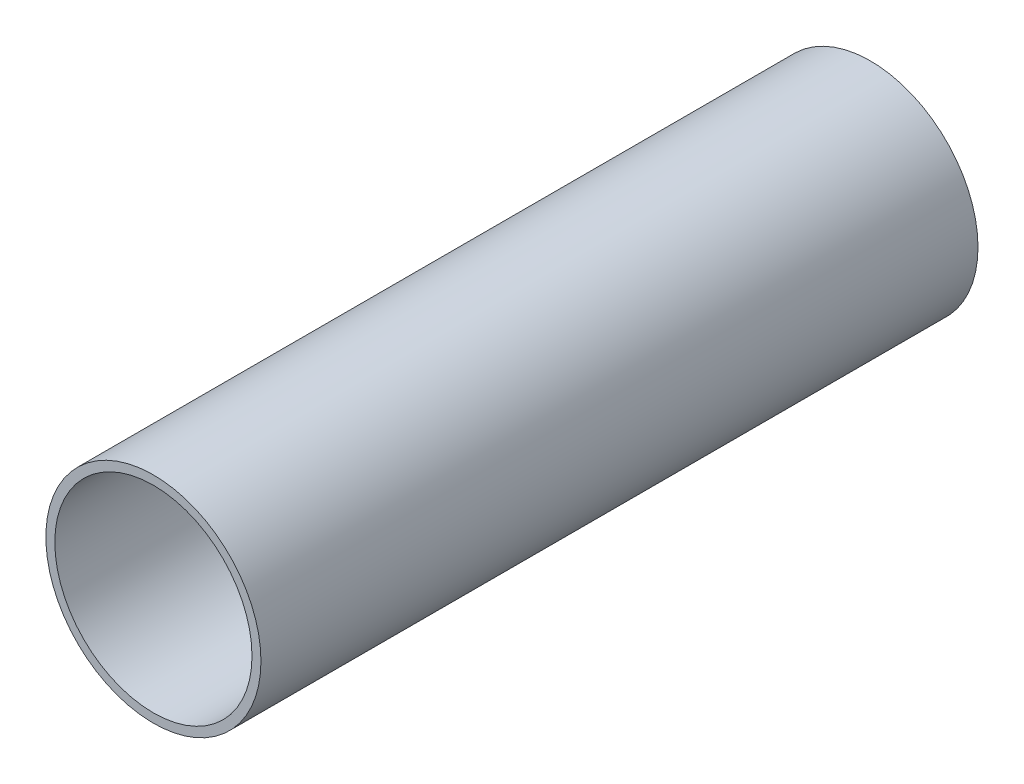
ISO-10303-21;
HEADER;
FILE_DESCRIPTION(('STEP AP214'),'2;1');
FILE_NAME('part.step','',(''),(''),'','','');
FILE_SCHEMA(('AUTOMOTIVE_DESIGN { 1 0 10303 214 1 1 1 1 }'));
ENDSEC;
DATA;
#1=APPLICATION_CONTEXT('core data for automotive mechanical design processes');
#2=APPLICATION_PROTOCOL_DEFINITION('international standard','automotive_design',2000,#1);
#3=PRODUCT_CONTEXT('',#1,'mechanical');
#4=PRODUCT('Part','Part','',(#3));
#5=PRODUCT_RELATED_PRODUCT_CATEGORY('part','',(#4));
#6=PRODUCT_DEFINITION_FORMATION('','',#4);
#7=PRODUCT_DEFINITION_CONTEXT('part definition',#1,'design');
#8=PRODUCT_DEFINITION('design','',#6,#7);
#9=PRODUCT_DEFINITION_SHAPE('','',#8);
#10=(LENGTH_UNIT() NAMED_UNIT(*) SI_UNIT(.MILLI.,.METRE.));
#11=(NAMED_UNIT(*) PLANE_ANGLE_UNIT() SI_UNIT($,.RADIAN.));
#12=(NAMED_UNIT(*) SI_UNIT($,.STERADIAN.) SOLID_ANGLE_UNIT());
#13=UNCERTAINTY_MEASURE_WITH_UNIT(LENGTH_MEASURE(1.E-05),#10,'distance_accuracy_value','');
#14=(GEOMETRIC_REPRESENTATION_CONTEXT(3) GLOBAL_UNCERTAINTY_ASSIGNED_CONTEXT((#13)) GLOBAL_UNIT_ASSIGNED_CONTEXT((#10,
#11,#12)) REPRESENTATION_CONTEXT('',''));
#15=CARTESIAN_POINT('',(0.,0.,0.));
#16=DIRECTION('',(0.,0.,1.));
#17=DIRECTION('',(1.,0.,0.));
#18=AXIS2_PLACEMENT_3D('',#15,#16,#17);
#19=CARTESIAN_POINT('',(0.,0.,-254.));
#20=DIRECTION('',(0.,0.,1.));
#21=DIRECTION('',(1.,0.,0.));
#22=AXIS2_PLACEMENT_3D('',#19,#20,#21);
#23=CYLINDRICAL_SURFACE('',#22,38.1);
#24=CARTESIAN_POINT('',(0.,0.,-254.));
#25=DIRECTION('',(0.,0.,1.));
#26=DIRECTION('',(1.,0.,0.));
#27=AXIS2_PLACEMENT_3D('',#24,#25,#26);
#28=CIRCLE('',#27,38.1);
#29=CARTESIAN_POINT('',(38.1,0.,-254.));
#30=VERTEX_POINT('',#29);
#31=EDGE_CURVE('E10',#30,#30,#28,.T.);
#32=ORIENTED_EDGE('',*,*,#31,.T.);
#33=EDGE_LOOP('',(#32));
#34=FACE_BOUND('',#33,.T.);
#35=CARTESIAN_POINT('',(0.,0.,0.));
#36=DIRECTION('',(0.,0.,1.));
#37=DIRECTION('',(1.,0.,0.));
#38=AXIS2_PLACEMENT_3D('',#35,#36,#37);
#39=CIRCLE('',#38,38.1);
#40=CARTESIAN_POINT('',(38.1,0.,0.));
#41=VERTEX_POINT('',#40);
#42=EDGE_CURVE('E34',#41,#41,#39,.T.);
#43=ORIENTED_EDGE('',*,*,#42,.F.);
#44=EDGE_LOOP('',(#43));
#45=FACE_BOUND('',#44,.T.);
#46=ADVANCED_FACE('F31',(#34,#45),#23,.T.);
#47=CARTESIAN_POINT('',(0.,0.,-254.));
#48=DIRECTION('',(0.,0.,1.));
#49=DIRECTION('',(1.,0.,0.));
#50=AXIS2_PLACEMENT_3D('',#47,#48,#49);
#51=PLANE('',#50);
#52=CARTESIAN_POINT('',(0.,0.,-254.));
#53=DIRECTION('',(0.,0.,1.));
#54=DIRECTION('',(1.,0.,0.));
#55=AXIS2_PLACEMENT_3D('',#52,#53,#54);
#56=CIRCLE('',#55,34.925);
#57=CARTESIAN_POINT('',(34.925,0.,-254.));
#58=VERTEX_POINT('',#57);
#59=EDGE_CURVE('E41',#58,#58,#56,.T.);
#60=ORIENTED_EDGE('',*,*,#59,.T.);
#61=EDGE_LOOP('',(#60));
#62=FACE_BOUND('',#61,.T.);
#63=ORIENTED_EDGE('',*,*,#31,.F.);
#64=EDGE_LOOP('',(#63));
#65=FACE_BOUND('',#64,.T.);
#66=ADVANCED_FACE('F49',(#62,#65),#51,.F.);
#67=CARTESIAN_POINT('',(0.,0.,0.));
#68=DIRECTION('',(0.,0.,1.));
#69=DIRECTION('',(1.,0.,0.));
#70=AXIS2_PLACEMENT_3D('',#67,#68,#69);
#71=PLANE('',#70);
#72=CARTESIAN_POINT('',(0.,0.,0.));
#73=DIRECTION('',(0.,0.,1.));
#74=DIRECTION('',(1.,0.,0.));
#75=AXIS2_PLACEMENT_3D('',#72,#73,#74);
#76=CIRCLE('',#75,34.925);
#77=CARTESIAN_POINT('',(34.925,0.,0.));
#78=VERTEX_POINT('',#77);
#79=EDGE_CURVE('E43',#78,#78,#76,.T.);
#80=ORIENTED_EDGE('',*,*,#79,.F.);
#81=EDGE_LOOP('',(#80));
#82=FACE_BOUND('',#81,.T.);
#83=ORIENTED_EDGE('',*,*,#42,.T.);
#84=EDGE_LOOP('',(#83));
#85=FACE_BOUND('',#84,.T.);
#86=ADVANCED_FACE('F55',(#82,#85),#71,.T.);
#87=CARTESIAN_POINT('',(0.,0.,-254.));
#88=DIRECTION('',(0.,0.,1.));
#89=DIRECTION('',(1.,0.,0.));
#90=AXIS2_PLACEMENT_3D('',#87,#88,#89);
#91=CYLINDRICAL_SURFACE('',#90,34.925);
#92=ORIENTED_EDGE('',*,*,#59,.F.);
#93=EDGE_LOOP('',(#92));
#94=FACE_BOUND('',#93,.T.);
#95=ORIENTED_EDGE('',*,*,#79,.T.);
#96=EDGE_LOOP('',(#95));
#97=FACE_BOUND('',#96,.T.);
#98=ADVANCED_FACE('F52',(#94,#97),#91,.F.);
#99=CLOSED_SHELL('',(#46,#66,#86,#98));
#100=MANIFOLD_SOLID_BREP('B2',#99);
#101=ADVANCED_BREP_SHAPE_REPRESENTATION('',(#18,#100),#14);
#102=SHAPE_DEFINITION_REPRESENTATION(#9,#101);
ENDSEC;
END-ISO-10303-21;
